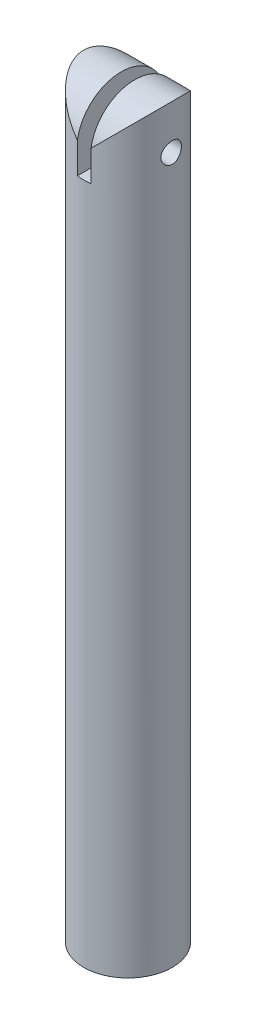
ISO-10303-21;
HEADER;
FILE_DESCRIPTION(('STEP AP214'),'2;1');
FILE_NAME('part.step','',(''),(''),'','','');
FILE_SCHEMA(('AUTOMOTIVE_DESIGN { 1 0 10303 214 1 1 1 1 }'));
ENDSEC;
DATA;
#1=APPLICATION_CONTEXT('core data for automotive mechanical design processes');
#2=APPLICATION_PROTOCOL_DEFINITION('international standard','automotive_design',2000,#1);
#3=PRODUCT_CONTEXT('',#1,'mechanical');
#4=PRODUCT('Part','Part','',(#3));
#5=PRODUCT_RELATED_PRODUCT_CATEGORY('part','',(#4));
#6=PRODUCT_DEFINITION_FORMATION('','',#4);
#7=PRODUCT_DEFINITION_CONTEXT('part definition',#1,'design');
#8=PRODUCT_DEFINITION('design','',#6,#7);
#9=PRODUCT_DEFINITION_SHAPE('','',#8);
#10=(LENGTH_UNIT() NAMED_UNIT(*) SI_UNIT(.MILLI.,.METRE.));
#11=(NAMED_UNIT(*) PLANE_ANGLE_UNIT() SI_UNIT($,.RADIAN.));
#12=(NAMED_UNIT(*) SI_UNIT($,.STERADIAN.) SOLID_ANGLE_UNIT());
#13=UNCERTAINTY_MEASURE_WITH_UNIT(LENGTH_MEASURE(1.E-05),#10,'distance_accuracy_value','');
#14=(GEOMETRIC_REPRESENTATION_CONTEXT(3) GLOBAL_UNCERTAINTY_ASSIGNED_CONTEXT((#13)) GLOBAL_UNIT_ASSIGNED_CONTEXT((#10,
#11,#12)) REPRESENTATION_CONTEXT('',''));
#15=CARTESIAN_POINT('',(0.,0.,0.));
#16=DIRECTION('',(0.,0.,1.));
#17=DIRECTION('',(1.,0.,0.));
#18=AXIS2_PLACEMENT_3D('',#15,#16,#17);
#19=CARTESIAN_POINT('',(0.,100.,0.));
#20=DIRECTION('',(0.,-1.,0.));
#21=DIRECTION('',(0.,0.,-1.));
#22=AXIS2_PLACEMENT_3D('',#19,#20,#21);
#23=CYLINDRICAL_SURFACE('',#22,6.5);
#24=CARTESIAN_POINT('',(6.5,102.,0.));
#25=CARTESIAN_POINT('',(6.49999849532867,102.000002665356,0.0830761724763344));
#26=CARTESIAN_POINT('',(6.49839124214547,102.006924926811,0.166183602986827));
#27=CARTESIAN_POINT('',(6.49213500375529,102.034397642886,0.330029933246627));
#28=CARTESIAN_POINT('',(6.48748401185166,102.054957088441,0.410767233683363));
#29=CARTESIAN_POINT('',(6.47565710646771,102.109019698941,0.567482400649438));
#30=CARTESIAN_POINT('',(6.46848397910972,102.142508585131,0.643465410431955));
#31=CARTESIAN_POINT('',(6.45238316831829,102.221432265068,0.788732955280499));
#32=CARTESIAN_POINT('',(6.44345549077589,102.266867018706,0.858017512835939));
#33=CARTESIAN_POINT('',(6.42464323305021,102.369245251677,0.989152353123208));
#34=CARTESIAN_POINT('',(6.41474568654138,102.426360361703,1.0508667921612));
#35=CARTESIAN_POINT('',(6.39519859507266,102.550109926571,1.16393060397695));
#36=CARTESIAN_POINT('',(6.38554907436474,102.61674530816,1.2152789664991));
#37=CARTESIAN_POINT('',(6.36746174180576,102.75866692756,1.3067669575256));
#38=CARTESIAN_POINT('',(6.35904049089481,102.834050440977,1.34675925477788));
#39=CARTESIAN_POINT('',(6.34455046029963,102.990695098651,1.41345395330061));
#40=CARTESIAN_POINT('',(6.33848136485541,103.071955452245,1.44015813854148));
#41=CARTESIAN_POINT('',(6.32951534623235,103.236565801583,1.4790642425856));
#42=CARTESIAN_POINT('',(6.32656557105072,103.319855673375,1.49150809496879));
#43=CARTESIAN_POINT('',(6.32401364937952,103.487389087046,1.50229307046533));
#44=CARTESIAN_POINT('',(6.32441104286173,103.571632496283,1.50063613156308));
#45=CARTESIAN_POINT('',(6.32846083321139,103.736862807824,1.48346063285703));
#46=CARTESIAN_POINT('',(6.33204661249556,103.817881081344,1.46822575315178));
#47=CARTESIAN_POINT('',(6.34196351386388,103.976179791902,1.42477741479348));
#48=CARTESIAN_POINT('',(6.34829480548987,104.053459997777,1.39656315462671));
#49=CARTESIAN_POINT('',(6.36305332227188,104.202872671641,1.32770349075046));
#50=CARTESIAN_POINT('',(6.37149843240945,104.274954080911,1.28695129246528));
#51=CARTESIAN_POINT('',(6.38952239681953,104.411359236289,1.19424748975256));
#52=CARTESIAN_POINT('',(6.39910142196225,104.475681810259,1.1422941964553));
#53=CARTESIAN_POINT('',(6.41859777640793,104.596373950051,1.02717321086452));
#54=CARTESIAN_POINT('',(6.42851768847713,104.652513885125,0.963764950845052));
#55=CARTESIAN_POINT('',(6.44736816069401,104.753403070975,0.828318641053406));
#56=CARTESIAN_POINT('',(6.45629869876005,104.798152067549,0.756280398745031));
#57=CARTESIAN_POINT('',(6.47219854082993,104.875055914143,0.605321277972372));
#58=CARTESIAN_POINT('',(6.47916273202417,104.907178015693,0.526383143294248));
#59=CARTESIAN_POINT('',(6.49030757986402,104.957636143695,0.36403239625258));
#60=CARTESIAN_POINT('',(6.49448868821629,104.975974407388,0.280620512374233));
#61=CARTESIAN_POINT('',(6.49953102945198,104.998004150348,0.113657323931635));
#62=CARTESIAN_POINT('',(6.50046326526885,105.00200893606,0.0301494450127242));
#63=CARTESIAN_POINT('',(6.49910299913129,104.996110985241,-0.136342371579227));
#64=CARTESIAN_POINT('',(6.49681074208307,104.986209304932,-0.219326348562748));
#65=CARTESIAN_POINT('',(6.48930412349636,104.953038803394,-0.381357903798025));
#66=CARTESIAN_POINT('',(6.48412623941868,104.929936758683,-0.460441464875702));
#67=CARTESIAN_POINT('',(6.47142910428788,104.871208411076,-0.613609622481667));
#68=CARTESIAN_POINT('',(6.4639096389422,104.835580961864,-0.687693760726589));
#69=CARTESIAN_POINT('',(6.44718996088191,104.752177356079,-0.83003761511019));
#70=CARTESIAN_POINT('',(6.43796535296184,104.704220308115,-0.898188410296329));
#71=CARTESIAN_POINT('',(6.41890391913982,104.597754382641,-1.02558718048179));
#72=CARTESIAN_POINT('',(6.40906700421673,104.539243968458,-1.08483385664762));
#73=CARTESIAN_POINT('',(6.38964047483402,104.411887614121,-1.19400102833017));
#74=CARTESIAN_POINT('',(6.3800601750374,104.342853035323,-1.24370343589041));
#75=CARTESIAN_POINT('',(6.36246188496285,104.197234119785,-1.33081235446409));
#76=CARTESIAN_POINT('',(6.35444382521927,104.120650118962,-1.3682194122462));
#77=CARTESIAN_POINT('',(6.34095951164845,103.962524011577,-1.4294106686813));
#78=CARTESIAN_POINT('',(6.33547846174878,103.881013870317,-1.45327404481083));
#79=CARTESIAN_POINT('',(6.3276660054956,103.714996007152,-1.48692530676327));
#80=CARTESIAN_POINT('',(6.32533402889436,103.63048883081,-1.49671574099563));
#81=CARTESIAN_POINT('',(6.32412253425542,103.463081772947,-1.50182536015786));
#82=CARTESIAN_POINT('',(6.32516029248235,103.380192889351,-1.49749127871471));
#83=CARTESIAN_POINT('',(6.33038270361014,103.216361321332,-1.47525685980881));
#84=CARTESIAN_POINT('',(6.33456731037362,103.135418608392,-1.45735672124419));
#85=CARTESIAN_POINT('',(6.34556939165105,102.978090089209,-1.40867420720144));
#86=CARTESIAN_POINT('',(6.35237543592818,102.901686139294,-1.37794771033572));
#87=CARTESIAN_POINT('',(6.36785683112449,102.755068193459,-1.304530822271));
#88=CARTESIAN_POINT('',(6.37653240158127,102.684854925873,-1.26183902581514));
#89=CARTESIAN_POINT('',(6.39501829374307,102.55091447141,-1.16457679516263));
#90=CARTESIAN_POINT('',(6.4048496868242,102.48736788045,-1.10976162033287));
#91=CARTESIAN_POINT('',(6.42440402438128,102.370261752362,-0.990297714593211));
#92=CARTESIAN_POINT('',(6.43412694306169,102.31670454507,-0.92564669602438));
#93=CARTESIAN_POINT('',(6.45253999299533,102.220332732051,-0.787191932761555));
#94=CARTESIAN_POINT('',(6.46121270567525,102.17768888171,-0.713266869084887));
#95=CARTESIAN_POINT('',(6.47637045552876,102.105500850591,-0.559109641475369));
#96=CARTESIAN_POINT('',(6.48285722936411,102.075946264897,-0.478882547101936));
#97=CARTESIAN_POINT('',(6.49182723396727,102.035721526444,-0.33221037419877));
#98=CARTESIAN_POINT('',(6.49487228966801,102.022352728973,-0.26652636732101));
#99=CARTESIAN_POINT('',(6.4989592245111,102.004491133385,-0.133901630280836));
#100=CARTESIAN_POINT('',(6.5000012127936,101.999997851673,-0.0669609687898312));
#101=CARTESIAN_POINT('',(6.5,102.,0.));
#102=B_SPLINE_CURVE_WITH_KNOTS('',3,(#24,#25,#26,#27,#28,#29,#30,#31,#32,#33,#34,#35,#36,#37,
#38,#39,#40,#41,#42,#43,#44,#45,#46,#47,#48,#49,#50,#51,#52,#53,#54,#55,#56,#57,#58,#59,#60,#61,
#62,#63,#64,#65,#66,#67,#68,#69,#70,#71,#72,#73,#74,#75,#76,#77,#78,#79,#80,#81,#82,#83,#84,#85,
#86,#87,#88,#89,#90,#91,#92,#93,#94,#95,#96,#97,#98,#99,#100,#101),.UNSPECIFIED.,.T.,.F.,(4,2,2,
2,2,2,2,2,2,2,2,2,2,2,2,2,2,2,2,2,2,2,2,2,2,2,2,2,2,2,2,2,2,2,2,2,2,2,4),(0.,0.248983311217115,
0.498130939431099,0.747004202472743,0.995876629917198,1.24870930222222,1.50156660317465,
1.7575684010941,2.0135358206962,2.26509316141455,2.51661592915602,2.76300377758329,
3.00940684320484,3.25796969712264,3.50657005489343,3.76117526279511,4.01578615203543,
4.27105309773002,4.52627860236006,4.77589001432916,5.02548246887371,5.27198911757478,
5.51851833225482,5.76889433751053,6.01930682944868,6.27489540554877,6.53047261420163,
6.78453988631542,7.03856114466417,7.28639401438666,7.53422325058918,7.78098389306532,
8.02777352833802,8.28009323709708,8.53247172133003,8.78858609727297,9.04449651578222,
9.24519271684377,9.44587798236135),.UNSPECIFIED.);
#103=CARTESIAN_POINT('',(6.5,102.,0.));
#104=VERTEX_POINT('',#103);
#105=EDGE_CURVE('E98',#104,#104,#102,.T.);
#106=ORIENTED_EDGE('',*,*,#105,.T.);
#107=EDGE_LOOP('',(#106));
#108=FACE_BOUND('',#107,.T.);
#109=CARTESIAN_POINT('',(-6.32455532033676,103.5,1.5));
#110=CARTESIAN_POINT('',(-6.3245569864533,103.416957035185,1.49999731225034));
#111=CARTESIAN_POINT('',(-6.32620871498674,103.333882759781,1.49308039515328));
#112=CARTESIAN_POINT('',(-6.33262329615483,103.170105237916,1.46563082834672));
#113=CARTESIAN_POINT('',(-6.33738823434819,103.089403618811,1.44508905111762));
#114=CARTESIAN_POINT('',(-6.34946149326292,102.93276408072,1.39107808122442));
#115=CARTESIAN_POINT('',(-6.35676684114118,102.856820715579,1.3576239938208));
#116=CARTESIAN_POINT('',(-6.37309417235741,102.711620196556,1.27878238190571));
#117=CARTESIAN_POINT('',(-6.3821161610391,102.642363063487,1.23339482024644));
#118=CARTESIAN_POINT('',(-6.40104967504166,102.511199772803,1.13106531351183));
#119=CARTESIAN_POINT('',(-6.41097365327686,102.449437569439,1.0739411222239));
#120=CARTESIAN_POINT('',(-6.43048432059803,102.336280855448,0.950153022384891));
#121=CARTESIAN_POINT('',(-6.44007098152558,102.284887208677,0.883488319758367));
#122=CARTESIAN_POINT('',(-6.45796329743801,102.193349779548,0.741538525798748));
#123=CARTESIAN_POINT('',(-6.46625254288521,102.153345561131,0.666161188886949));
#124=CARTESIAN_POINT('',(-6.4804748675058,102.08662714992,0.509529827009778));
#125=CARTESIAN_POINT('',(-6.48640824159883,102.059911293517,0.428276539131445));
#126=CARTESIAN_POINT('',(-6.49516228038752,102.020983836108,0.263698138287241));
#127=CARTESIAN_POINT('',(-6.49803523989436,102.008528276248,0.18043355746171));
#128=CARTESIAN_POINT('',(-6.50052632032964,101.997711106336,0.0129504286120441));
#129=CARTESIAN_POINT('',(-6.50014485393698,101.999347709321,-0.0712679971068365));
#130=CARTESIAN_POINT('',(-6.49620964643357,102.016489016338,-0.236582621768763));
#131=CARTESIAN_POINT('',(-6.49271608840583,102.031730631616,-0.31770774532044));
#132=CARTESIAN_POINT('',(-6.48301834797385,102.075228725327,-0.476216582142183));
#133=CARTESIAN_POINT('',(-6.47681403431541,102.103485833971,-0.553600114043639));
#134=CARTESIAN_POINT('',(-6.46229685303168,102.172438075129,-0.703145641253891));
#135=CARTESIAN_POINT('',(-6.45396755520295,102.2132306579,-0.775261043983782));
#136=CARTESIAN_POINT('',(-6.43611015762813,102.306022793184,-0.911717486022493));
#137=CARTESIAN_POINT('',(-6.42658187760235,102.358024031878,-0.976057353339065));
#138=CARTESIAN_POINT('',(-6.40711077081721,102.473181753154,-1.09670294212735));
#139=CARTESIAN_POINT('',(-6.39716345312091,102.536568412229,-1.15278844211966));
#140=CARTESIAN_POINT('',(-6.37818005958509,102.671951232213,-1.25357772612111));
#141=CARTESIAN_POINT('',(-6.36914401445328,102.743947683072,-1.29828112665809));
#142=CARTESIAN_POINT('',(-6.35299268291512,102.894890257044,-1.375150736671));
#143=CARTESIAN_POINT('',(-6.34588444121947,102.973860507588,-1.40727114955079));
#144=CARTESIAN_POINT('',(-6.33448805998483,103.136281777224,-1.45771632822007));
#145=CARTESIAN_POINT('',(-6.3301994165034,103.219731992734,-1.47604355932844));
#146=CARTESIAN_POINT('',(-6.3250317404996,103.386720920002,-1.49803182193799));
#147=CARTESIAN_POINT('',(-6.32407774971017,103.470214898764,-1.5020153425849));
#148=CARTESIAN_POINT('',(-6.32548450645529,103.636674037239,-1.49607984528294));
#149=CARTESIAN_POINT('',(-6.32784499818498,103.719639237265,-1.48616190022036));
#150=CARTESIAN_POINT('',(-6.33554357373051,103.88153554522,-1.45298594915779));
#151=CARTESIAN_POINT('',(-6.34084115536032,103.960505918806,-1.42990927996822));
#152=CARTESIAN_POINT('',(-6.35377976011193,104.113458782927,-1.37126901136113));
#153=CARTESIAN_POINT('',(-6.36142102796637,104.187440751577,-1.33570410783976));
#154=CARTESIAN_POINT('',(-6.37834816430389,104.32970153688,-1.25239967909705));
#155=CARTESIAN_POINT('',(-6.38765975817363,104.397862164511,-1.20446365753872));
#156=CARTESIAN_POINT('',(-6.40681231547821,104.525290362933,-1.09803158820713));
#157=CARTESIAN_POINT('',(-6.41665335234628,104.584556695751,-1.03953407290059));
#158=CARTESIAN_POINT('',(-6.43600563629776,104.6937858147,-0.91217245428965));
#159=CARTESIAN_POINT('',(-6.44550564512701,104.743527522127,-0.843116740081712));
#160=CARTESIAN_POINT('',(-6.46288988462929,104.830705402499,-0.697443174334201));
#161=CARTESIAN_POINT('',(-6.47077419484896,104.868142181313,-0.620825695362715));
#162=CARTESIAN_POINT('',(-6.48399176445978,104.929349737919,-0.462705252392972));
#163=CARTESIAN_POINT('',(-6.48934209685309,104.95321220028,-0.381239271946516));
#164=CARTESIAN_POINT('',(-6.49696306189839,104.986876518472,-0.215316112505567));
#165=CARTESIAN_POINT('',(-6.4992341959149,104.996680663336,-0.130859422765991));
#166=CARTESIAN_POINT('',(-6.50042390805381,105.001837452283,0.0365573790394527));
#167=CARTESIAN_POINT('',(-6.49941871891103,104.997518697002,0.119506994675797));
#168=CARTESIAN_POINT('',(-6.49433417348681,104.975293814493,0.283464184827982));
#169=CARTESIAN_POINT('',(-6.49025488508533,104.957387987285,0.364471802184826));
#170=CARTESIAN_POINT('',(-6.47948846592308,104.908662018416,0.521957811169671));
#171=CARTESIAN_POINT('',(-6.47281172349154,104.877893284899,0.598452864232119));
#172=CARTESIAN_POINT('',(-6.45755951980291,104.804363318543,0.745235906918296));
#173=CARTESIAN_POINT('',(-6.448983852572,104.761600784619,0.815523222039256));
#174=CARTESIAN_POINT('',(-6.43064181454253,104.664251243952,0.949482403657662));
#175=CARTESIAN_POINT('',(-6.42085432839479,104.609436079266,1.01298558523276));
#176=CARTESIAN_POINT('',(-6.40129818016079,104.489991211453,1.13000416077695));
#177=CARTESIAN_POINT('',(-6.3915295232739,104.42535910706,1.18351710393229));
#178=CARTESIAN_POINT('',(-6.37294956195203,104.286928019355,1.27982908304766));
#179=CARTESIAN_POINT('',(-6.36415514239876,104.213004195153,1.32245215470278));
#180=CARTESIAN_POINT('',(-6.34873668426056,104.058852158348,1.39460165995166));
#181=CARTESIAN_POINT('',(-6.34211090335334,103.978629071259,1.42413861394222));
#182=CARTESIAN_POINT('',(-6.332935958069,103.832000881066,1.46432382845631));
#183=CARTESIAN_POINT('',(-6.32981507708548,103.766359139735,1.47767548439029));
#184=CARTESIAN_POINT('',(-6.32562414905362,103.633818325437,1.49551438449417));
#185=CARTESIAN_POINT('',(-6.32455397771369,103.56691932892,1.50000216589574));
#186=CARTESIAN_POINT('',(-6.32455532033676,103.5,1.5));
#187=B_SPLINE_CURVE_WITH_KNOTS('',3,(#109,#110,#111,#112,#113,#114,#115,#116,#117,#118,#119,
#120,#121,#122,#123,#124,#125,#126,#127,#128,#129,#130,#131,#132,#133,#134,#135,#136,#137,#138,
#139,#140,#141,#142,#143,#144,#145,#146,#147,#148,#149,#150,#151,#152,#153,#154,#155,#156,#157,
#158,#159,#160,#161,#162,#163,#164,#165,#166,#167,#168,#169,#170,#171,#172,#173,#174,#175,#176,
#177,#178,#179,#180,#181,#182,#183,#184,#185,#186),.UNSPECIFIED.,.T.,.F.,(4,2,2,2,2,2,2,2,2,2,2,
2,2,2,2,2,2,2,2,2,2,2,2,2,2,2,2,2,2,2,2,2,2,2,2,2,2,2,4),(0.,0.248883465803477,
0.497933831393372,0.74669372812554,0.99545439923348,1.24841764299144,1.50140195363393,
1.75736456623773,2.01329512606391,2.26477865330973,2.51623029155069,2.76292232697429,
3.00962630849786,3.25829886944376,3.50700886572536,3.76147084783258,4.01594140183622,
4.27132969927229,4.52667233913446,4.77623696750946,5.02578233606487,5.2719691404944,
5.51818166102456,5.76857543923029,6.01900403679121,6.27468245443433,6.53034828108672,
6.78426611877413,7.03814260781421,7.28615450356158,7.53416092305585,7.78118549040831,
8.02823686531902,8.28044436759847,8.53271366056538,8.78883275968401,9.04474558022916,
9.24531794770394,9.44587815829013),.UNSPECIFIED.);
#188=CARTESIAN_POINT('',(-6.32455532033676,103.5,1.5));
#189=VERTEX_POINT('',#188);
#190=EDGE_CURVE('E159',#189,#189,#187,.T.);
#191=ORIENTED_EDGE('',*,*,#190,.T.);
#192=EDGE_LOOP('',(#191));
#193=FACE_BOUND('',#192,.T.);
#194=CARTESIAN_POINT('',(0.,0.,0.));
#195=DIRECTION('',(0.,1.,0.));
#196=DIRECTION('',(0.,0.,1.));
#197=AXIS2_PLACEMENT_3D('',#194,#195,#196);
#198=CIRCLE('',#197,6.5);
#199=CARTESIAN_POINT('',(0.,0.,6.5));
#200=VERTEX_POINT('',#199);
#201=EDGE_CURVE('E122',#200,#200,#198,.T.);
#202=ORIENTED_EDGE('',*,*,#201,.T.);
#203=EDGE_LOOP('',(#202));
#204=FACE_BOUND('',#203,.T.);
#205=CARTESIAN_POINT('',(0.,103.5,0.));
#206=DIRECTION('',(0.707106781186547,-0.707106781186547,0.));
#207=DIRECTION('',(-0.707106781186547,-0.707106781186547,0.));
#208=AXIS2_PLACEMENT_3D('',#205,#206,#207);
#209=ELLIPSE('',#208,9.19238815542512,6.5);
#210=CARTESIAN_POINT('',(1.,104.5,6.42261628933257));
#211=VERTEX_POINT('',#210);
#212=CARTESIAN_POINT('',(1.,104.5,-6.42261628933256));
#213=VERTEX_POINT('',#212);
#214=EDGE_CURVE('E178',#211,#213,#209,.F.);
#215=ORIENTED_EDGE('',*,*,#214,.F.);
#216=DIRECTION('',(0.,-1.,0.));
#217=VECTOR('',#216,1.);
#218=CARTESIAN_POINT('',(1.,110.,6.42261628933257));
#219=LINE('',#218,#217);
#220=CARTESIAN_POINT('',(1.,100.,6.42261628933257));
#221=VERTEX_POINT('',#220);
#222=EDGE_CURVE('E108',#211,#221,#219,.T.);
#223=ORIENTED_EDGE('',*,*,#222,.T.);
#224=CARTESIAN_POINT('',(0.,100.,0.));
#225=DIRECTION('',(0.,1.,0.));
#226=DIRECTION('',(0.,0.,1.));
#227=AXIS2_PLACEMENT_3D('',#224,#225,#226);
#228=CIRCLE('',#227,6.5);
#229=CARTESIAN_POINT('',(-1.,100.,6.42261628933257));
#230=VERTEX_POINT('',#229);
#231=EDGE_CURVE('E49',#230,#221,#228,.T.);
#232=ORIENTED_EDGE('',*,*,#231,.F.);
#233=DIRECTION('',(0.,-1.,0.));
#234=VECTOR('',#233,1.);
#235=CARTESIAN_POINT('',(-1.,110.,6.42261628933257));
#236=LINE('',#235,#234);
#237=CARTESIAN_POINT('',(-1.,104.5,6.42261628933257));
#238=VERTEX_POINT('',#237);
#239=EDGE_CURVE('E95',#238,#230,#236,.T.);
#240=ORIENTED_EDGE('',*,*,#239,.F.);
#241=CARTESIAN_POINT('',(0.,103.5,0.));
#242=DIRECTION('',(-0.707106781186547,-0.707106781186547,0.));
#243=DIRECTION('',(0.707106781186547,-0.707106781186547,0.));
#244=AXIS2_PLACEMENT_3D('',#241,#242,#243);
#245=ELLIPSE('',#244,9.19238815542512,6.5);
#246=CARTESIAN_POINT('',(-1.,104.5,-6.42261628933256));
#247=VERTEX_POINT('',#246);
#248=EDGE_CURVE('E84',#247,#238,#245,.F.);
#249=ORIENTED_EDGE('',*,*,#248,.F.);
#250=DIRECTION('',(0.,-1.,0.));
#251=VECTOR('',#250,1.);
#252=CARTESIAN_POINT('',(-0.999999999999999,110.,-6.42261628933256));
#253=LINE('',#252,#251);
#254=CARTESIAN_POINT('',(-0.999999999999999,100.,-6.42261628933256));
#255=VERTEX_POINT('',#254);
#256=EDGE_CURVE('E57',#247,#255,#253,.T.);
#257=ORIENTED_EDGE('',*,*,#256,.T.);
#258=CARTESIAN_POINT('',(1.,100.,-6.42261628933257));
#259=VERTEX_POINT('',#258);
#260=EDGE_CURVE('E11',#259,#255,#228,.T.);
#261=ORIENTED_EDGE('',*,*,#260,.F.);
#262=DIRECTION('',(0.,-1.,0.));
#263=VECTOR('',#262,1.);
#264=CARTESIAN_POINT('',(1.,110.,-6.42261628933256));
#265=LINE('',#264,#263);
#266=EDGE_CURVE('E64',#213,#259,#265,.T.);
#267=ORIENTED_EDGE('',*,*,#266,.F.);
#268=EDGE_LOOP('',(#215,#223,#232,#240,#249,#257,#261,#267));
#269=FACE_BOUND('',#268,.T.);
#270=ADVANCED_FACE('F39',(#108,#193,#204,#269),#23,.T.);
#271=CARTESIAN_POINT('',(1.,110.,6.42261628933257));
#272=DIRECTION('',(1.,0.,0.));
#273=DIRECTION('',(0.,0.,-1.));
#274=AXIS2_PLACEMENT_3D('',#271,#272,#273);
#275=PLANE('',#274);
#276=CARTESIAN_POINT('',(1.,103.5,0.));
#277=DIRECTION('',(1.,0.,0.));
#278=DIRECTION('',(0.,0.,-1.));
#279=AXIS2_PLACEMENT_3D('',#276,#277,#278);
#280=CIRCLE('',#279,1.5);
#281=CARTESIAN_POINT('',(1.,103.5,-1.5));
#282=VERTEX_POINT('',#281);
#283=EDGE_CURVE('E214',#282,#282,#280,.T.);
#284=ORIENTED_EDGE('',*,*,#283,.T.);
#285=EDGE_LOOP('',(#284));
#286=FACE_BOUND('',#285,.T.);
#287=ORIENTED_EDGE('',*,*,#222,.F.);
#288=CARTESIAN_POINT('',(1.,103.5,0.));
#289=DIRECTION('',(1.,0.,0.));
#290=DIRECTION('',(0.,0.,-1.));
#291=AXIS2_PLACEMENT_3D('',#288,#289,#290);
#292=CIRCLE('',#291,6.5);
#293=EDGE_CURVE('E90',#213,#211,#292,.T.);
#294=ORIENTED_EDGE('',*,*,#293,.F.);
#295=ORIENTED_EDGE('',*,*,#266,.T.);
#296=DIRECTION('',(0.,0.,1.));
#297=VECTOR('',#296,1.);
#298=CARTESIAN_POINT('',(1.,100.,6.42261628933257));
#299=LINE('',#298,#297);
#300=EDGE_CURVE('E104',#259,#221,#299,.T.);
#301=ORIENTED_EDGE('',*,*,#300,.T.);
#302=EDGE_LOOP('',(#287,#294,#295,#301));
#303=FACE_BOUND('',#302,.T.);
#304=ADVANCED_FACE('F147',(#286,#303),#275,.F.);
#305=CARTESIAN_POINT('',(-1.,110.,6.42261628933257));
#306=DIRECTION('',(-1.,0.,0.));
#307=DIRECTION('',(0.,0.,1.));
#308=AXIS2_PLACEMENT_3D('',#305,#306,#307);
#309=PLANE('',#308);
#310=CARTESIAN_POINT('',(-1.,103.5,0.));
#311=DIRECTION('',(-1.,0.,0.));
#312=DIRECTION('',(0.,0.,1.));
#313=AXIS2_PLACEMENT_3D('',#310,#311,#312);
#314=CIRCLE('',#313,1.5);
#315=CARTESIAN_POINT('',(-1.,103.5,1.5));
#316=VERTEX_POINT('',#315);
#317=EDGE_CURVE('E43',#316,#316,#314,.T.);
#318=ORIENTED_EDGE('',*,*,#317,.T.);
#319=EDGE_LOOP('',(#318));
#320=FACE_BOUND('',#319,.T.);
#321=CARTESIAN_POINT('',(-1.,103.5,0.));
#322=DIRECTION('',(-1.,0.,0.));
#323=DIRECTION('',(0.,0.,1.));
#324=AXIS2_PLACEMENT_3D('',#321,#322,#323);
#325=CIRCLE('',#324,6.5);
#326=EDGE_CURVE('E87',#238,#247,#325,.T.);
#327=ORIENTED_EDGE('',*,*,#326,.F.);
#328=ORIENTED_EDGE('',*,*,#239,.T.);
#329=DIRECTION('',(0.,0.,-1.));
#330=VECTOR('',#329,1.);
#331=CARTESIAN_POINT('',(-1.,100.,6.42261628933257));
#332=LINE('',#331,#330);
#333=EDGE_CURVE('E110',#230,#255,#332,.T.);
#334=ORIENTED_EDGE('',*,*,#333,.T.);
#335=ORIENTED_EDGE('',*,*,#256,.F.);
#336=EDGE_LOOP('',(#327,#328,#334,#335));
#337=FACE_BOUND('',#336,.T.);
#338=ADVANCED_FACE('F93',(#320,#337),#309,.F.);
#339=CARTESIAN_POINT('',(0.,100.,0.));
#340=DIRECTION('',(0.,1.,0.));
#341=DIRECTION('',(0.,0.,1.));
#342=AXIS2_PLACEMENT_3D('',#339,#340,#341);
#343=PLANE('',#342);
#344=ORIENTED_EDGE('',*,*,#260,.T.);
#345=ORIENTED_EDGE('',*,*,#333,.F.);
#346=ORIENTED_EDGE('',*,*,#231,.T.);
#347=ORIENTED_EDGE('',*,*,#300,.F.);
#348=EDGE_LOOP('',(#344,#345,#346,#347));
#349=FACE_BOUND('',#348,.T.);
#350=ADVANCED_FACE('F165',(#349),#343,.T.);
#351=CARTESIAN_POINT('',(0.,100.,0.));
#352=DIRECTION('',(0.,-1.,0.));
#353=DIRECTION('',(0.,0.,-1.));
#354=AXIS2_PLACEMENT_3D('',#351,#352,#353);
#355=CYLINDRICAL_SURFACE('',#354,2.5);
#356=CARTESIAN_POINT('',(0.,0.,0.));
#357=DIRECTION('',(0.,1.,0.));
#358=DIRECTION('',(0.,0.,1.));
#359=AXIS2_PLACEMENT_3D('',#356,#357,#358);
#360=CIRCLE('',#359,2.5);
#361=CARTESIAN_POINT('',(0.,0.,2.5));
#362=VERTEX_POINT('',#361);
#363=EDGE_CURVE('E119',#362,#362,#360,.T.);
#364=ORIENTED_EDGE('',*,*,#363,.F.);
#365=EDGE_LOOP('',(#364));
#366=FACE_BOUND('',#365,.T.);
#367=CARTESIAN_POINT('',(0.,90.,0.));
#368=DIRECTION('',(0.,1.,0.));
#369=DIRECTION('',(0.,0.,1.));
#370=AXIS2_PLACEMENT_3D('',#367,#368,#369);
#371=CIRCLE('',#370,2.5);
#372=CARTESIAN_POINT('',(0.,90.,2.5));
#373=VERTEX_POINT('',#372);
#374=EDGE_CURVE('E118',#373,#373,#371,.T.);
#375=ORIENTED_EDGE('',*,*,#374,.T.);
#376=EDGE_LOOP('',(#375));
#377=FACE_BOUND('',#376,.T.);
#378=ADVANCED_FACE('F130',(#366,#377),#355,.F.);
#379=CARTESIAN_POINT('',(0.,0.,0.));
#380=DIRECTION('',(0.,1.,0.));
#381=DIRECTION('',(0.,0.,1.));
#382=AXIS2_PLACEMENT_3D('',#379,#380,#381);
#383=PLANE('',#382);
#384=ORIENTED_EDGE('',*,*,#201,.F.);
#385=EDGE_LOOP('',(#384));
#386=FACE_BOUND('',#385,.T.);
#387=ORIENTED_EDGE('',*,*,#363,.T.);
#388=EDGE_LOOP('',(#387));
#389=FACE_BOUND('',#388,.T.);
#390=ADVANCED_FACE('F134',(#386,#389),#383,.F.);
#391=CARTESIAN_POINT('',(0.,90.,0.));
#392=DIRECTION('',(0.,1.,0.));
#393=DIRECTION('',(0.,0.,1.));
#394=AXIS2_PLACEMENT_3D('',#391,#392,#393);
#395=PLANE('',#394);
#396=ORIENTED_EDGE('',*,*,#374,.F.);
#397=EDGE_LOOP('',(#396));
#398=FACE_BOUND('',#397,.T.);
#399=ADVANCED_FACE('F132',(#398),#395,.F.);
#400=CARTESIAN_POINT('',(-6.5,103.5,0.));
#401=DIRECTION('',(1.,0.,0.));
#402=DIRECTION('',(0.,0.,-1.));
#403=AXIS2_PLACEMENT_3D('',#400,#401,#402);
#404=CYLINDRICAL_SURFACE('',#403,6.5);
#405=ORIENTED_EDGE('',*,*,#248,.T.);
#406=ORIENTED_EDGE('',*,*,#326,.T.);
#407=EDGE_LOOP('',(#405,#406));
#408=FACE_BOUND('',#407,.T.);
#409=ADVANCED_FACE('F86',(#408),#404,.T.);
#410=ORIENTED_EDGE('',*,*,#214,.T.);
#411=ORIENTED_EDGE('',*,*,#293,.T.);
#412=EDGE_LOOP('',(#410,#411));
#413=FACE_BOUND('',#412,.T.);
#414=ADVANCED_FACE('F141',(#413),#404,.T.);
#415=CARTESIAN_POINT('',(6.5,103.5,0.));
#416=DIRECTION('',(-1.,0.,0.));
#417=DIRECTION('',(0.,0.,1.));
#418=AXIS2_PLACEMENT_3D('',#415,#416,#417);
#419=CYLINDRICAL_SURFACE('',#418,1.5);
#420=ORIENTED_EDGE('',*,*,#317,.F.);
#421=EDGE_LOOP('',(#420));
#422=FACE_BOUND('',#421,.T.);
#423=ORIENTED_EDGE('',*,*,#190,.F.);
#424=EDGE_LOOP('',(#423));
#425=FACE_BOUND('',#424,.T.);
#426=ADVANCED_FACE('F197',(#422,#425),#419,.F.);
#427=ORIENTED_EDGE('',*,*,#283,.F.);
#428=EDGE_LOOP('',(#427));
#429=FACE_BOUND('',#428,.T.);
#430=ORIENTED_EDGE('',*,*,#105,.F.);
#431=EDGE_LOOP('',(#430));
#432=FACE_BOUND('',#431,.T.);
#433=ADVANCED_FACE('F194',(#429,#432),#419,.F.);
#434=CLOSED_SHELL('',(#270,#304,#338,#350,#378,#390,#399,#409,#414,#426,#433));
#435=MANIFOLD_SOLID_BREP('B2',#434);
#436=ADVANCED_BREP_SHAPE_REPRESENTATION('',(#18,#435),#14);
#437=SHAPE_DEFINITION_REPRESENTATION(#9,#436);
ENDSEC;
END-ISO-10303-21;
